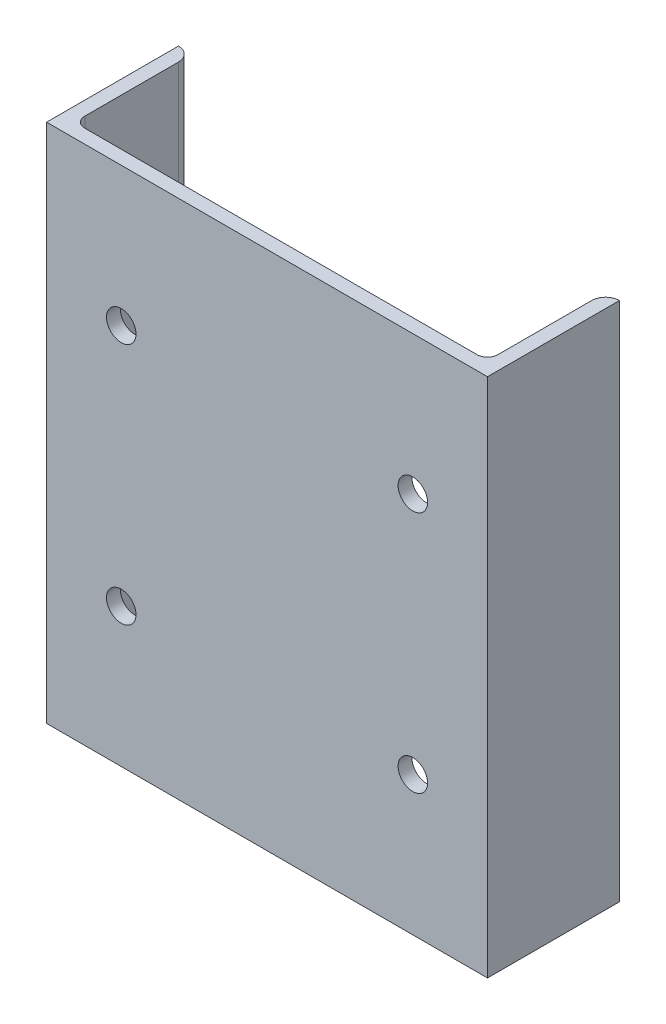
ISO-10303-21;
HEADER;
FILE_DESCRIPTION(('STEP AP214'),'2;1');
FILE_NAME('part.step','',(''),(''),'','','');
FILE_SCHEMA(('AUTOMOTIVE_DESIGN { 1 0 10303 214 1 1 1 1 }'));
ENDSEC;
DATA;
#1=APPLICATION_CONTEXT('core data for automotive mechanical design processes');
#2=APPLICATION_PROTOCOL_DEFINITION('international standard','automotive_design',2000,#1);
#3=PRODUCT_CONTEXT('',#1,'mechanical');
#4=PRODUCT('Part','Part','',(#3));
#5=PRODUCT_RELATED_PRODUCT_CATEGORY('part','',(#4));
#6=PRODUCT_DEFINITION_FORMATION('','',#4);
#7=PRODUCT_DEFINITION_CONTEXT('part definition',#1,'design');
#8=PRODUCT_DEFINITION('design','',#6,#7);
#9=PRODUCT_DEFINITION_SHAPE('','',#8);
#10=(LENGTH_UNIT() NAMED_UNIT(*) SI_UNIT(.MILLI.,.METRE.));
#11=(NAMED_UNIT(*) PLANE_ANGLE_UNIT() SI_UNIT($,.RADIAN.));
#12=(NAMED_UNIT(*) SI_UNIT($,.STERADIAN.) SOLID_ANGLE_UNIT());
#13=UNCERTAINTY_MEASURE_WITH_UNIT(LENGTH_MEASURE(1.E-05),#10,'distance_accuracy_value','');
#14=(GEOMETRIC_REPRESENTATION_CONTEXT(3) GLOBAL_UNCERTAINTY_ASSIGNED_CONTEXT((#13)) GLOBAL_UNIT_ASSIGNED_CONTEXT((#10,
#11,#12)) REPRESENTATION_CONTEXT('',''));
#15=CARTESIAN_POINT('',(0.,0.,0.));
#16=DIRECTION('',(0.,0.,1.));
#17=DIRECTION('',(1.,0.,0.));
#18=AXIS2_PLACEMENT_3D('',#15,#16,#17);
#19=CARTESIAN_POINT('',(-127.,150.,0.));
#20=DIRECTION('',(1.,0.,0.));
#21=DIRECTION('',(0.,0.,-1.));
#22=AXIS2_PLACEMENT_3D('',#19,#20,#21);
#23=PLANE('',#22);
#24=DIRECTION('',(0.,0.,1.));
#25=VECTOR('',#24,1.);
#26=CARTESIAN_POINT('',(-127.,-150.,0.));
#27=LINE('',#26,#25);
#28=CARTESIAN_POINT('',(-127.,-150.,-76.));
#29=VERTEX_POINT('',#28);
#30=CARTESIAN_POINT('',(-127.,-150.,0.));
#31=VERTEX_POINT('',#30);
#32=EDGE_CURVE('E112',#29,#31,#27,.T.);
#33=ORIENTED_EDGE('',*,*,#32,.T.);
#34=DIRECTION('',(0.,-1.,0.));
#35=VECTOR('',#34,1.);
#36=CARTESIAN_POINT('',(-127.,150.,0.));
#37=LINE('',#36,#35);
#38=CARTESIAN_POINT('',(-127.,150.,0.));
#39=VERTEX_POINT('',#38);
#40=EDGE_CURVE('E11',#39,#31,#37,.T.);
#41=ORIENTED_EDGE('',*,*,#40,.F.);
#42=DIRECTION('',(0.,0.,1.));
#43=VECTOR('',#42,1.);
#44=CARTESIAN_POINT('',(-127.,150.,0.));
#45=LINE('',#44,#43);
#46=CARTESIAN_POINT('',(-127.,150.,-76.));
#47=VERTEX_POINT('',#46);
#48=EDGE_CURVE('E148',#47,#39,#45,.T.);
#49=ORIENTED_EDGE('',*,*,#48,.F.);
#50=DIRECTION('',(0.,-1.,0.));
#51=VECTOR('',#50,1.);
#52=CARTESIAN_POINT('',(-127.,150.,-76.));
#53=LINE('',#52,#51);
#54=EDGE_CURVE('E125',#47,#29,#53,.T.);
#55=ORIENTED_EDGE('',*,*,#54,.T.);
#56=EDGE_LOOP('',(#33,#41,#49,#55));
#57=FACE_BOUND('',#56,.T.);
#58=ADVANCED_FACE('F32',(#57),#23,.F.);
#59=CARTESIAN_POINT('',(-127.,150.,0.));
#60=DIRECTION('',(0.,0.,-1.));
#61=DIRECTION('',(-1.,0.,0.));
#62=AXIS2_PLACEMENT_3D('',#59,#60,#61);
#63=PLANE('',#62);
#64=CARTESIAN_POINT('',(84.,-70.,0.));
#65=DIRECTION('',(0.,0.,1.));
#66=DIRECTION('',(1.,0.,0.));
#67=AXIS2_PLACEMENT_3D('',#64,#65,#66);
#68=CIRCLE('',#67,8.50000000000001);
#69=CARTESIAN_POINT('',(92.5,-70.,0.));
#70=VERTEX_POINT('',#69);
#71=EDGE_CURVE('E334',#70,#70,#68,.T.);
#72=ORIENTED_EDGE('',*,*,#71,.F.);
#73=EDGE_LOOP('',(#72));
#74=FACE_BOUND('',#73,.T.);
#75=CARTESIAN_POINT('',(-84.,-70.,0.));
#76=DIRECTION('',(0.,0.,1.));
#77=DIRECTION('',(1.,0.,0.));
#78=AXIS2_PLACEMENT_3D('',#75,#76,#77);
#79=CIRCLE('',#78,8.49999999999999);
#80=CARTESIAN_POINT('',(-75.5,-70.,0.));
#81=VERTEX_POINT('',#80);
#82=EDGE_CURVE('E338',#81,#81,#79,.T.);
#83=ORIENTED_EDGE('',*,*,#82,.F.);
#84=EDGE_LOOP('',(#83));
#85=FACE_BOUND('',#84,.T.);
#86=CARTESIAN_POINT('',(-84.,70.,0.));
#87=DIRECTION('',(0.,0.,1.));
#88=DIRECTION('',(1.,0.,0.));
#89=AXIS2_PLACEMENT_3D('',#86,#87,#88);
#90=CIRCLE('',#89,8.49999999999999);
#91=CARTESIAN_POINT('',(-75.5,70.,0.));
#92=VERTEX_POINT('',#91);
#93=EDGE_CURVE('E347',#92,#92,#90,.T.);
#94=ORIENTED_EDGE('',*,*,#93,.F.);
#95=EDGE_LOOP('',(#94));
#96=FACE_BOUND('',#95,.T.);
#97=CARTESIAN_POINT('',(84.,70.,0.));
#98=DIRECTION('',(0.,0.,1.));
#99=DIRECTION('',(1.,0.,0.));
#100=AXIS2_PLACEMENT_3D('',#97,#98,#99);
#101=CIRCLE('',#100,8.50000000000001);
#102=CARTESIAN_POINT('',(92.5,70.,0.));
#103=VERTEX_POINT('',#102);
#104=EDGE_CURVE('E129',#103,#103,#101,.T.);
#105=ORIENTED_EDGE('',*,*,#104,.F.);
#106=EDGE_LOOP('',(#105));
#107=FACE_BOUND('',#106,.T.);
#108=DIRECTION('',(1.,0.,0.));
#109=VECTOR('',#108,1.);
#110=CARTESIAN_POINT('',(-127.,-150.,0.));
#111=LINE('',#110,#109);
#112=CARTESIAN_POINT('',(127.,-150.,0.));
#113=VERTEX_POINT('',#112);
#114=EDGE_CURVE('E108',#31,#113,#111,.T.);
#115=ORIENTED_EDGE('',*,*,#114,.T.);
#116=DIRECTION('',(0.,-1.,0.));
#117=VECTOR('',#116,1.);
#118=CARTESIAN_POINT('',(127.,150.,0.));
#119=LINE('',#118,#117);
#120=CARTESIAN_POINT('',(127.,150.,0.));
#121=VERTEX_POINT('',#120);
#122=EDGE_CURVE('E39',#121,#113,#119,.T.);
#123=ORIENTED_EDGE('',*,*,#122,.F.);
#124=DIRECTION('',(1.,0.,0.));
#125=VECTOR('',#124,1.);
#126=CARTESIAN_POINT('',(-127.,150.,0.));
#127=LINE('',#126,#125);
#128=EDGE_CURVE('E121',#39,#121,#127,.T.);
#129=ORIENTED_EDGE('',*,*,#128,.F.);
#130=ORIENTED_EDGE('',*,*,#40,.T.);
#131=EDGE_LOOP('',(#115,#123,#129,#130));
#132=FACE_BOUND('',#131,.T.);
#133=ADVANCED_FACE('F120',(#74,#85,#96,#107,#132),#63,.F.);
#134=CARTESIAN_POINT('',(127.,150.,0.));
#135=DIRECTION('',(-1.,0.,0.));
#136=DIRECTION('',(0.,0.,1.));
#137=AXIS2_PLACEMENT_3D('',#134,#135,#136);
#138=PLANE('',#137);
#139=DIRECTION('',(0.,0.,-1.));
#140=VECTOR('',#139,1.);
#141=CARTESIAN_POINT('',(127.,-150.,0.));
#142=LINE('',#141,#140);
#143=CARTESIAN_POINT('',(127.,-150.,-76.));
#144=VERTEX_POINT('',#143);
#145=EDGE_CURVE('E114',#113,#144,#142,.T.);
#146=ORIENTED_EDGE('',*,*,#145,.T.);
#147=DIRECTION('',(0.,-1.,0.));
#148=VECTOR('',#147,1.);
#149=CARTESIAN_POINT('',(127.,150.,-76.));
#150=LINE('',#149,#148);
#151=CARTESIAN_POINT('',(127.,150.,-76.));
#152=VERTEX_POINT('',#151);
#153=EDGE_CURVE('E184',#152,#144,#150,.T.);
#154=ORIENTED_EDGE('',*,*,#153,.F.);
#155=DIRECTION('',(0.,0.,-1.));
#156=VECTOR('',#155,1.);
#157=CARTESIAN_POINT('',(127.,150.,0.));
#158=LINE('',#157,#156);
#159=EDGE_CURVE('E151',#121,#152,#158,.T.);
#160=ORIENTED_EDGE('',*,*,#159,.F.);
#161=ORIENTED_EDGE('',*,*,#122,.T.);
#162=EDGE_LOOP('',(#146,#154,#160,#161));
#163=FACE_BOUND('',#162,.T.);
#164=ADVANCED_FACE('F188',(#163),#138,.F.);
#165=CARTESIAN_POINT('',(127.,150.,-68.));
#166=DIRECTION('',(0.,-1.,0.));
#167=DIRECTION('',(0.,0.,-1.));
#168=AXIS2_PLACEMENT_3D('',#165,#166,#167);
#169=CYLINDRICAL_SURFACE('',#168,8.);
#170=CARTESIAN_POINT('',(127.,-150.,-68.));
#171=DIRECTION('',(0.,1.,0.));
#172=DIRECTION('',(0.,0.,-1.));
#173=AXIS2_PLACEMENT_3D('',#170,#171,#172);
#174=CIRCLE('',#173,8.);
#175=CARTESIAN_POINT('',(119.,-150.,-68.));
#176=VERTEX_POINT('',#175);
#177=EDGE_CURVE('E134',#144,#176,#174,.T.);
#178=ORIENTED_EDGE('',*,*,#177,.T.);
#179=DIRECTION('',(0.,-1.,0.));
#180=VECTOR('',#179,1.);
#181=CARTESIAN_POINT('',(119.,150.,-68.));
#182=LINE('',#181,#180);
#183=CARTESIAN_POINT('',(119.,150.,-68.));
#184=VERTEX_POINT('',#183);
#185=EDGE_CURVE('E181',#184,#176,#182,.T.);
#186=ORIENTED_EDGE('',*,*,#185,.F.);
#187=CARTESIAN_POINT('',(127.,150.,-68.));
#188=DIRECTION('',(0.,1.,0.));
#189=DIRECTION('',(0.,0.,-1.));
#190=AXIS2_PLACEMENT_3D('',#187,#188,#189);
#191=CIRCLE('',#190,8.);
#192=EDGE_CURVE('E153',#152,#184,#191,.T.);
#193=ORIENTED_EDGE('',*,*,#192,.F.);
#194=ORIENTED_EDGE('',*,*,#153,.T.);
#195=EDGE_LOOP('',(#178,#186,#193,#194));
#196=FACE_BOUND('',#195,.T.);
#197=ADVANCED_FACE('F196',(#196),#169,.T.);
#198=CARTESIAN_POINT('',(119.,150.,-14.));
#199=DIRECTION('',(1.,0.,0.));
#200=DIRECTION('',(0.,0.,-1.));
#201=AXIS2_PLACEMENT_3D('',#198,#199,#200);
#202=PLANE('',#201);
#203=DIRECTION('',(0.,0.,1.));
#204=VECTOR('',#203,1.);
#205=CARTESIAN_POINT('',(119.,-150.,-14.));
#206=LINE('',#205,#204);
#207=CARTESIAN_POINT('',(119.,-150.,-14.));
#208=VERTEX_POINT('',#207);
#209=EDGE_CURVE('E136',#176,#208,#206,.T.);
#210=ORIENTED_EDGE('',*,*,#209,.T.);
#211=DIRECTION('',(0.,-1.,0.));
#212=VECTOR('',#211,1.);
#213=CARTESIAN_POINT('',(119.,150.,-14.));
#214=LINE('',#213,#212);
#215=CARTESIAN_POINT('',(119.,150.,-14.));
#216=VERTEX_POINT('',#215);
#217=EDGE_CURVE('E178',#216,#208,#214,.T.);
#218=ORIENTED_EDGE('',*,*,#217,.F.);
#219=DIRECTION('',(0.,0.,1.));
#220=VECTOR('',#219,1.);
#221=CARTESIAN_POINT('',(119.,150.,-14.));
#222=LINE('',#221,#220);
#223=EDGE_CURVE('E155',#184,#216,#222,.T.);
#224=ORIENTED_EDGE('',*,*,#223,.F.);
#225=ORIENTED_EDGE('',*,*,#185,.T.);
#226=EDGE_LOOP('',(#210,#218,#224,#225));
#227=FACE_BOUND('',#226,.T.);
#228=ADVANCED_FACE('F199',(#227),#202,.F.);
#229=CARTESIAN_POINT('',(113.,150.,-14.));
#230=DIRECTION('',(0.,-1.,0.));
#231=DIRECTION('',(0.,0.,-1.));
#232=AXIS2_PLACEMENT_3D('',#229,#230,#231);
#233=CYLINDRICAL_SURFACE('',#232,6.);
#234=CARTESIAN_POINT('',(113.,-150.,-14.));
#235=DIRECTION('',(0.,-1.,0.));
#236=DIRECTION('',(0.,0.,1.));
#237=AXIS2_PLACEMENT_3D('',#234,#235,#236);
#238=CIRCLE('',#237,6.);
#239=CARTESIAN_POINT('',(113.,-150.,-8.));
#240=VERTEX_POINT('',#239);
#241=EDGE_CURVE('E138',#208,#240,#238,.T.);
#242=ORIENTED_EDGE('',*,*,#241,.T.);
#243=DIRECTION('',(0.,-1.,0.));
#244=VECTOR('',#243,1.);
#245=CARTESIAN_POINT('',(113.,150.,-8.));
#246=LINE('',#245,#244);
#247=CARTESIAN_POINT('',(113.,150.,-8.));
#248=VERTEX_POINT('',#247);
#249=EDGE_CURVE('E175',#248,#240,#246,.T.);
#250=ORIENTED_EDGE('',*,*,#249,.F.);
#251=CARTESIAN_POINT('',(113.,150.,-14.));
#252=DIRECTION('',(0.,-1.,0.));
#253=DIRECTION('',(0.,0.,1.));
#254=AXIS2_PLACEMENT_3D('',#251,#252,#253);
#255=CIRCLE('',#254,6.);
#256=EDGE_CURVE('E157',#216,#248,#255,.T.);
#257=ORIENTED_EDGE('',*,*,#256,.F.);
#258=ORIENTED_EDGE('',*,*,#217,.T.);
#259=EDGE_LOOP('',(#242,#250,#257,#258));
#260=FACE_BOUND('',#259,.T.);
#261=ADVANCED_FACE('F204',(#260),#233,.F.);
#262=CARTESIAN_POINT('',(-113.,150.,-8.));
#263=DIRECTION('',(0.,0.,1.));
#264=DIRECTION('',(1.,0.,0.));
#265=AXIS2_PLACEMENT_3D('',#262,#263,#264);
#266=PLANE('',#265);
#267=CARTESIAN_POINT('',(84.,-70.,-8.00000000000001));
#268=DIRECTION('',(0.,0.,1.));
#269=DIRECTION('',(1.,0.,0.));
#270=AXIS2_PLACEMENT_3D('',#267,#268,#269);
#271=CIRCLE('',#270,8.50000000000001);
#272=CARTESIAN_POINT('',(92.5,-70.,-8.00000000000001));
#273=VERTEX_POINT('',#272);
#274=EDGE_CURVE('E337',#273,#273,#271,.F.);
#275=ORIENTED_EDGE('',*,*,#274,.F.);
#276=EDGE_LOOP('',(#275));
#277=FACE_BOUND('',#276,.T.);
#278=CARTESIAN_POINT('',(-84.,-70.,-8.00000000000001));
#279=DIRECTION('',(0.,0.,1.));
#280=DIRECTION('',(1.,0.,0.));
#281=AXIS2_PLACEMENT_3D('',#278,#279,#280);
#282=CIRCLE('',#281,8.49999999999999);
#283=CARTESIAN_POINT('',(-75.5,-70.,-8.00000000000001));
#284=VERTEX_POINT('',#283);
#285=EDGE_CURVE('E341',#284,#284,#282,.F.);
#286=ORIENTED_EDGE('',*,*,#285,.F.);
#287=EDGE_LOOP('',(#286));
#288=FACE_BOUND('',#287,.T.);
#289=CARTESIAN_POINT('',(-84.,70.,-8.00000000000001));
#290=DIRECTION('',(0.,0.,1.));
#291=DIRECTION('',(1.,0.,0.));
#292=AXIS2_PLACEMENT_3D('',#289,#290,#291);
#293=CIRCLE('',#292,8.49999999999999);
#294=CARTESIAN_POINT('',(-75.5,70.,-8.00000000000001));
#295=VERTEX_POINT('',#294);
#296=EDGE_CURVE('E350',#295,#295,#293,.F.);
#297=ORIENTED_EDGE('',*,*,#296,.F.);
#298=EDGE_LOOP('',(#297));
#299=FACE_BOUND('',#298,.T.);
#300=CARTESIAN_POINT('',(84.,70.,-8.00000000000001));
#301=DIRECTION('',(0.,0.,1.));
#302=DIRECTION('',(1.,0.,0.));
#303=AXIS2_PLACEMENT_3D('',#300,#301,#302);
#304=CIRCLE('',#303,8.50000000000001);
#305=CARTESIAN_POINT('',(92.5,70.,-8.00000000000001));
#306=VERTEX_POINT('',#305);
#307=EDGE_CURVE('E126',#306,#306,#304,.F.);
#308=ORIENTED_EDGE('',*,*,#307,.F.);
#309=EDGE_LOOP('',(#308));
#310=FACE_BOUND('',#309,.T.);
#311=DIRECTION('',(-1.,0.,0.));
#312=VECTOR('',#311,1.);
#313=CARTESIAN_POINT('',(-113.,-150.,-8.));
#314=LINE('',#313,#312);
#315=CARTESIAN_POINT('',(-113.,-150.,-8.));
#316=VERTEX_POINT('',#315);
#317=EDGE_CURVE('E140',#240,#316,#314,.T.);
#318=ORIENTED_EDGE('',*,*,#317,.T.);
#319=DIRECTION('',(0.,-1.,0.));
#320=VECTOR('',#319,1.);
#321=CARTESIAN_POINT('',(-113.,150.,-8.));
#322=LINE('',#321,#320);
#323=CARTESIAN_POINT('',(-113.,150.,-8.));
#324=VERTEX_POINT('',#323);
#325=EDGE_CURVE('E172',#324,#316,#322,.T.);
#326=ORIENTED_EDGE('',*,*,#325,.F.);
#327=DIRECTION('',(-1.,0.,0.));
#328=VECTOR('',#327,1.);
#329=CARTESIAN_POINT('',(-113.,150.,-8.));
#330=LINE('',#329,#328);
#331=EDGE_CURVE('E159',#248,#324,#330,.T.);
#332=ORIENTED_EDGE('',*,*,#331,.F.);
#333=ORIENTED_EDGE('',*,*,#249,.T.);
#334=EDGE_LOOP('',(#318,#326,#332,#333));
#335=FACE_BOUND('',#334,.T.);
#336=ADVANCED_FACE('F210',(#277,#288,#299,#310,#335),#266,.F.);
#337=CARTESIAN_POINT('',(-113.,150.,-14.));
#338=DIRECTION('',(0.,-1.,0.));
#339=DIRECTION('',(0.,0.,-1.));
#340=AXIS2_PLACEMENT_3D('',#337,#338,#339);
#341=CYLINDRICAL_SURFACE('',#340,6.);
#342=CARTESIAN_POINT('',(-113.,-150.,-14.));
#343=DIRECTION('',(0.,-1.,0.));
#344=DIRECTION('',(0.,0.,-1.));
#345=AXIS2_PLACEMENT_3D('',#342,#343,#344);
#346=CIRCLE('',#345,6.);
#347=CARTESIAN_POINT('',(-119.,-150.,-14.));
#348=VERTEX_POINT('',#347);
#349=EDGE_CURVE('E142',#316,#348,#346,.T.);
#350=ORIENTED_EDGE('',*,*,#349,.T.);
#351=DIRECTION('',(0.,-1.,0.));
#352=VECTOR('',#351,1.);
#353=CARTESIAN_POINT('',(-119.,150.,-14.));
#354=LINE('',#353,#352);
#355=CARTESIAN_POINT('',(-119.,150.,-14.));
#356=VERTEX_POINT('',#355);
#357=EDGE_CURVE('E169',#356,#348,#354,.T.);
#358=ORIENTED_EDGE('',*,*,#357,.F.);
#359=CARTESIAN_POINT('',(-113.,150.,-14.));
#360=DIRECTION('',(0.,-1.,0.));
#361=DIRECTION('',(0.,0.,-1.));
#362=AXIS2_PLACEMENT_3D('',#359,#360,#361);
#363=CIRCLE('',#362,6.);
#364=EDGE_CURVE('E161',#324,#356,#363,.T.);
#365=ORIENTED_EDGE('',*,*,#364,.F.);
#366=ORIENTED_EDGE('',*,*,#325,.T.);
#367=EDGE_LOOP('',(#350,#358,#365,#366));
#368=FACE_BOUND('',#367,.T.);
#369=ADVANCED_FACE('F214',(#368),#341,.F.);
#370=CARTESIAN_POINT('',(-119.,150.,-14.));
#371=DIRECTION('',(-1.,0.,0.));
#372=DIRECTION('',(0.,0.,1.));
#373=AXIS2_PLACEMENT_3D('',#370,#371,#372);
#374=PLANE('',#373);
#375=DIRECTION('',(0.,0.,-1.));
#376=VECTOR('',#375,1.);
#377=CARTESIAN_POINT('',(-119.,-150.,-14.));
#378=LINE('',#377,#376);
#379=CARTESIAN_POINT('',(-119.,-150.,-68.));
#380=VERTEX_POINT('',#379);
#381=EDGE_CURVE('E144',#348,#380,#378,.T.);
#382=ORIENTED_EDGE('',*,*,#381,.T.);
#383=DIRECTION('',(0.,-1.,0.));
#384=VECTOR('',#383,1.);
#385=CARTESIAN_POINT('',(-119.,150.,-68.));
#386=LINE('',#385,#384);
#387=CARTESIAN_POINT('',(-119.,150.,-68.));
#388=VERTEX_POINT('',#387);
#389=EDGE_CURVE('E166',#388,#380,#386,.T.);
#390=ORIENTED_EDGE('',*,*,#389,.F.);
#391=DIRECTION('',(0.,0.,-1.));
#392=VECTOR('',#391,1.);
#393=CARTESIAN_POINT('',(-119.,150.,-14.));
#394=LINE('',#393,#392);
#395=EDGE_CURVE('E51',#356,#388,#394,.T.);
#396=ORIENTED_EDGE('',*,*,#395,.F.);
#397=ORIENTED_EDGE('',*,*,#357,.T.);
#398=EDGE_LOOP('',(#382,#390,#396,#397));
#399=FACE_BOUND('',#398,.T.);
#400=ADVANCED_FACE('F217',(#399),#374,.F.);
#401=CARTESIAN_POINT('',(-127.,150.,-68.));
#402=DIRECTION('',(0.,-1.,0.));
#403=DIRECTION('',(0.,0.,-1.));
#404=AXIS2_PLACEMENT_3D('',#401,#402,#403);
#405=CYLINDRICAL_SURFACE('',#404,8.);
#406=CARTESIAN_POINT('',(-127.,-150.,-68.));
#407=DIRECTION('',(0.,1.,0.));
#408=DIRECTION('',(0.,0.,1.));
#409=AXIS2_PLACEMENT_3D('',#406,#407,#408);
#410=CIRCLE('',#409,8.);
#411=EDGE_CURVE('E146',#380,#29,#410,.T.);
#412=ORIENTED_EDGE('',*,*,#411,.T.);
#413=ORIENTED_EDGE('',*,*,#54,.F.);
#414=CARTESIAN_POINT('',(-127.,150.,-68.));
#415=DIRECTION('',(0.,1.,0.));
#416=DIRECTION('',(0.,0.,1.));
#417=AXIS2_PLACEMENT_3D('',#414,#415,#416);
#418=CIRCLE('',#417,8.);
#419=EDGE_CURVE('E46',#388,#47,#418,.T.);
#420=ORIENTED_EDGE('',*,*,#419,.F.);
#421=ORIENTED_EDGE('',*,*,#389,.T.);
#422=EDGE_LOOP('',(#412,#413,#420,#421));
#423=FACE_BOUND('',#422,.T.);
#424=ADVANCED_FACE('F219',(#423),#405,.T.);
#425=CARTESIAN_POINT('',(-127.,150.,-68.));
#426=DIRECTION('',(0.,1.,0.));
#427=DIRECTION('',(0.,0.,1.));
#428=AXIS2_PLACEMENT_3D('',#425,#426,#427);
#429=PLANE('',#428);
#430=ORIENTED_EDGE('',*,*,#48,.T.);
#431=ORIENTED_EDGE('',*,*,#128,.T.);
#432=ORIENTED_EDGE('',*,*,#159,.T.);
#433=ORIENTED_EDGE('',*,*,#192,.T.);
#434=ORIENTED_EDGE('',*,*,#223,.T.);
#435=ORIENTED_EDGE('',*,*,#256,.T.);
#436=ORIENTED_EDGE('',*,*,#331,.T.);
#437=ORIENTED_EDGE('',*,*,#364,.T.);
#438=ORIENTED_EDGE('',*,*,#395,.T.);
#439=ORIENTED_EDGE('',*,*,#419,.T.);
#440=EDGE_LOOP('',(#430,#431,#432,#433,#434,#435,#436,#437,#438,#439));
#441=FACE_BOUND('',#440,.T.);
#442=ADVANCED_FACE('F191',(#441),#429,.T.);
#443=CARTESIAN_POINT('',(-127.,-150.,-68.));
#444=DIRECTION('',(0.,1.,0.));
#445=DIRECTION('',(0.,0.,1.));
#446=AXIS2_PLACEMENT_3D('',#443,#444,#445);
#447=PLANE('',#446);
#448=ORIENTED_EDGE('',*,*,#32,.F.);
#449=ORIENTED_EDGE('',*,*,#411,.F.);
#450=ORIENTED_EDGE('',*,*,#381,.F.);
#451=ORIENTED_EDGE('',*,*,#349,.F.);
#452=ORIENTED_EDGE('',*,*,#317,.F.);
#453=ORIENTED_EDGE('',*,*,#241,.F.);
#454=ORIENTED_EDGE('',*,*,#209,.F.);
#455=ORIENTED_EDGE('',*,*,#177,.F.);
#456=ORIENTED_EDGE('',*,*,#145,.F.);
#457=ORIENTED_EDGE('',*,*,#114,.F.);
#458=EDGE_LOOP('',(#448,#449,#450,#451,#452,#453,#454,#455,#456,#457));
#459=FACE_BOUND('',#458,.T.);
#460=ADVANCED_FACE('F109',(#459),#447,.F.);
#461=CARTESIAN_POINT('',(84.,70.,-76.001));
#462=DIRECTION('',(0.,0.,1.));
#463=DIRECTION('',(1.,0.,0.));
#464=AXIS2_PLACEMENT_3D('',#461,#462,#463);
#465=CYLINDRICAL_SURFACE('',#464,8.50000000000001);
#466=ORIENTED_EDGE('',*,*,#104,.T.);
#467=EDGE_LOOP('',(#466));
#468=FACE_BOUND('',#467,.T.);
#469=ORIENTED_EDGE('',*,*,#307,.T.);
#470=EDGE_LOOP('',(#469));
#471=FACE_BOUND('',#470,.T.);
#472=ADVANCED_FACE('F277',(#468,#471),#465,.F.);
#473=CARTESIAN_POINT('',(-84.,70.,-76.001));
#474=DIRECTION('',(0.,0.,1.));
#475=DIRECTION('',(1.,0.,0.));
#476=AXIS2_PLACEMENT_3D('',#473,#474,#475);
#477=CYLINDRICAL_SURFACE('',#476,8.49999999999999);
#478=ORIENTED_EDGE('',*,*,#93,.T.);
#479=EDGE_LOOP('',(#478));
#480=FACE_BOUND('',#479,.T.);
#481=ORIENTED_EDGE('',*,*,#296,.T.);
#482=EDGE_LOOP('',(#481));
#483=FACE_BOUND('',#482,.T.);
#484=ADVANCED_FACE('F298',(#480,#483),#477,.F.);
#485=CARTESIAN_POINT('',(-84.,-70.,-76.001));
#486=DIRECTION('',(0.,0.,1.));
#487=DIRECTION('',(1.,0.,0.));
#488=AXIS2_PLACEMENT_3D('',#485,#486,#487);
#489=CYLINDRICAL_SURFACE('',#488,8.49999999999999);
#490=ORIENTED_EDGE('',*,*,#82,.T.);
#491=EDGE_LOOP('',(#490));
#492=FACE_BOUND('',#491,.T.);
#493=ORIENTED_EDGE('',*,*,#285,.T.);
#494=EDGE_LOOP('',(#493));
#495=FACE_BOUND('',#494,.T.);
#496=ADVANCED_FACE('F308',(#492,#495),#489,.F.);
#497=CARTESIAN_POINT('',(84.,-70.,-76.001));
#498=DIRECTION('',(0.,0.,1.));
#499=DIRECTION('',(1.,0.,0.));
#500=AXIS2_PLACEMENT_3D('',#497,#498,#499);
#501=CYLINDRICAL_SURFACE('',#500,8.50000000000001);
#502=ORIENTED_EDGE('',*,*,#71,.T.);
#503=EDGE_LOOP('',(#502));
#504=FACE_BOUND('',#503,.T.);
#505=ORIENTED_EDGE('',*,*,#274,.T.);
#506=EDGE_LOOP('',(#505));
#507=FACE_BOUND('',#506,.T.);
#508=ADVANCED_FACE('F318',(#504,#507),#501,.F.);
#509=CLOSED_SHELL('',(#58,#133,#164,#197,#228,#261,#336,#369,#400,#424,#442,#460,#472,#484,#496,#508));
#510=MANIFOLD_SOLID_BREP('B2',#509);
#511=ADVANCED_BREP_SHAPE_REPRESENTATION('',(#18,#510),#14);
#512=SHAPE_DEFINITION_REPRESENTATION(#9,#511);
ENDSEC;
END-ISO-10303-21;
